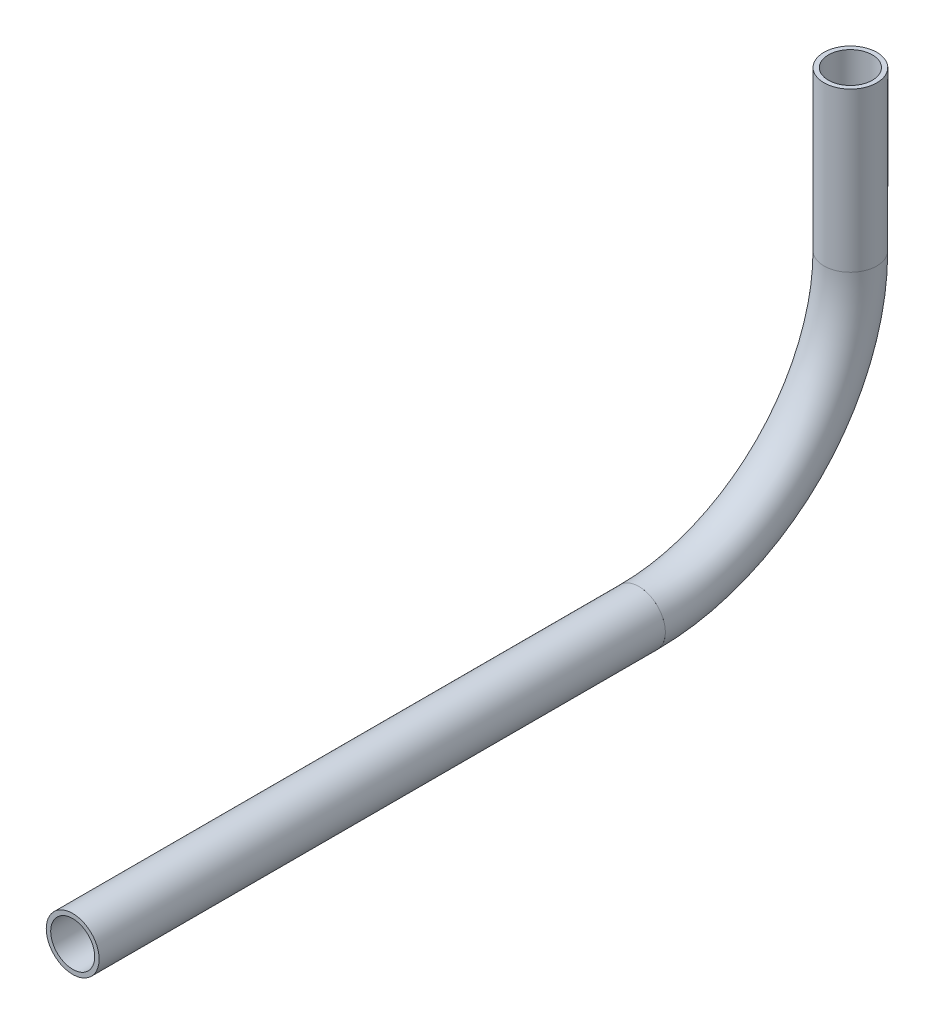
ISO-10303-21;
HEADER;
FILE_DESCRIPTION(('STEP AP214'),'2;1');
FILE_NAME('part.step','',(''),(''),'','','');
FILE_SCHEMA(('AUTOMOTIVE_DESIGN { 1 0 10303 214 1 1 1 1 }'));
ENDSEC;
DATA;
#1=APPLICATION_CONTEXT('core data for automotive mechanical design processes');
#2=APPLICATION_PROTOCOL_DEFINITION('international standard','automotive_design',2000,#1);
#3=PRODUCT_CONTEXT('',#1,'mechanical');
#4=PRODUCT('Part','Part','',(#3));
#5=PRODUCT_RELATED_PRODUCT_CATEGORY('part','',(#4));
#6=PRODUCT_DEFINITION_FORMATION('','',#4);
#7=PRODUCT_DEFINITION_CONTEXT('part definition',#1,'design');
#8=PRODUCT_DEFINITION('design','',#6,#7);
#9=PRODUCT_DEFINITION_SHAPE('','',#8);
#10=(LENGTH_UNIT() NAMED_UNIT(*) SI_UNIT(.MILLI.,.METRE.));
#11=(NAMED_UNIT(*) PLANE_ANGLE_UNIT() SI_UNIT($,.RADIAN.));
#12=(NAMED_UNIT(*) SI_UNIT($,.STERADIAN.) SOLID_ANGLE_UNIT());
#13=UNCERTAINTY_MEASURE_WITH_UNIT(LENGTH_MEASURE(1.E-05),#10,'distance_accuracy_value','');
#14=(GEOMETRIC_REPRESENTATION_CONTEXT(3) GLOBAL_UNCERTAINTY_ASSIGNED_CONTEXT((#13)) GLOBAL_UNIT_ASSIGNED_CONTEXT((#10,
#11,#12)) REPRESENTATION_CONTEXT('',''));
#15=CARTESIAN_POINT('',(0.,0.,0.));
#16=DIRECTION('',(0.,0.,1.));
#17=DIRECTION('',(1.,0.,0.));
#18=AXIS2_PLACEMENT_3D('',#15,#16,#17);
#19=CARTESIAN_POINT('',(0.,599.96001927236,167.15895807332));
#20=DIRECTION('',(0.,0.,1.));
#21=DIRECTION('',(1.,0.,0.));
#22=AXIS2_PLACEMENT_3D('',#19,#20,#21);
#23=CYLINDRICAL_SURFACE('',#22,5.28320000000004);
#24=CARTESIAN_POINT('',(0.,599.96001927236,303.16459571102));
#25=DIRECTION('',(0.,0.,-1.));
#26=DIRECTION('',(-1.,0.,0.));
#27=AXIS2_PLACEMENT_3D('',#24,#25,#26);
#28=CIRCLE('',#27,5.28320000000004);
#29=CARTESIAN_POINT('',(-5.28320000000004,599.96001927236,303.16459571102));
#30=VERTEX_POINT('',#29);
#31=EDGE_CURVE('E55',#30,#30,#28,.T.);
#32=ORIENTED_EDGE('',*,*,#31,.F.);
#33=EDGE_LOOP('',(#32));
#34=FACE_BOUND('',#33,.T.);
#35=CARTESIAN_POINT('',(0.,599.96001927236,167.15895807332));
#36=DIRECTION('',(0.,0.,-1.));
#37=DIRECTION('',(-1.,0.,0.));
#38=AXIS2_PLACEMENT_3D('',#35,#36,#37);
#39=CIRCLE('',#38,5.28320000000004);
#40=CARTESIAN_POINT('',(-5.28320000000004,599.96001927236,167.15895807332));
#41=VERTEX_POINT('',#40);
#42=EDGE_CURVE('E51',#41,#41,#39,.T.);
#43=ORIENTED_EDGE('',*,*,#42,.T.);
#44=EDGE_LOOP('',(#43));
#45=FACE_BOUND('',#44,.T.);
#46=ADVANCED_FACE('F47',(#34,#45),#23,.F.);
#47=CARTESIAN_POINT('',(0.,599.96001927236,167.15895807332));
#48=DIRECTION('',(0.,0.,1.));
#49=DIRECTION('',(1.,0.,0.));
#50=AXIS2_PLACEMENT_3D('',#47,#48,#49);
#51=CYLINDRICAL_SURFACE('',#50,6.35000000000005);
#52=CARTESIAN_POINT('',(0.,599.96001927236,303.16459571102));
#53=DIRECTION('',(0.,0.,-1.));
#54=DIRECTION('',(-1.,0.,0.));
#55=AXIS2_PLACEMENT_3D('',#52,#53,#54);
#56=CIRCLE('',#55,6.35000000000005);
#57=CARTESIAN_POINT('',(-6.35000000000005,599.96001927236,303.16459571102));
#58=VERTEX_POINT('',#57);
#59=EDGE_CURVE('E59',#58,#58,#56,.T.);
#60=ORIENTED_EDGE('',*,*,#59,.T.);
#61=EDGE_LOOP('',(#60));
#62=FACE_BOUND('',#61,.T.);
#63=CARTESIAN_POINT('',(0.,599.96001927236,167.15895807332));
#64=DIRECTION('',(0.,0.,-1.));
#65=DIRECTION('',(-1.,0.,0.));
#66=AXIS2_PLACEMENT_3D('',#63,#64,#65);
#67=CIRCLE('',#66,6.35000000000005);
#68=CARTESIAN_POINT('',(-6.35000000000005,599.96001927236,167.15895807332));
#69=VERTEX_POINT('',#68);
#70=EDGE_CURVE('E12',#69,#69,#67,.T.);
#71=ORIENTED_EDGE('',*,*,#70,.F.);
#72=EDGE_LOOP('',(#71));
#73=FACE_BOUND('',#72,.T.);
#74=ADVANCED_FACE('F74',(#62,#73),#51,.T.);
#75=CARTESIAN_POINT('',(0.,599.96001927236,303.16459571102));
#76=DIRECTION('',(0.,0.,-1.));
#77=DIRECTION('',(-1.,0.,0.));
#78=AXIS2_PLACEMENT_3D('',#75,#76,#77);
#79=PLANE('',#78);
#80=ORIENTED_EDGE('',*,*,#31,.T.);
#81=EDGE_LOOP('',(#80));
#82=FACE_BOUND('',#81,.T.);
#83=ORIENTED_EDGE('',*,*,#59,.F.);
#84=EDGE_LOOP('',(#83));
#85=FACE_BOUND('',#84,.T.);
#86=ADVANCED_FACE('F70',(#82,#85),#79,.F.);
#87=CARTESIAN_POINT('',(0.,599.96001927236,167.15895807332));
#88=DIRECTION('',(0.,0.,-1.));
#89=DIRECTION('',(-1.,0.,0.));
#90=AXIS2_PLACEMENT_3D('',#87,#88,#89);
#91=PLANE('',#90);
#92=ORIENTED_EDGE('',*,*,#42,.F.);
#93=EDGE_LOOP('',(#92));
#94=FACE_BOUND('',#93,.T.);
#95=ORIENTED_EDGE('',*,*,#70,.T.);
#96=EDGE_LOOP('',(#95));
#97=FACE_BOUND('',#96,.T.);
#98=ADVANCED_FACE('F49',(#94,#97),#91,.T.);
#99=CLOSED_SHELL('',(#46,#74,#86,#98));
#100=MANIFOLD_SOLID_BREP('B2',#99);
#101=CARTESIAN_POINT('',(0.,650.76001927236,167.15895807332));
#102=DIRECTION('',(-1.,0.,0.));
#103=DIRECTION('',(0.,0.,1.));
#104=AXIS2_PLACEMENT_3D('',#101,#102,#103);
#105=TOROIDAL_SURFACE('',#104,50.8,5.28320000000004);
#106=CARTESIAN_POINT('',(0.,650.76001927236,116.35895807332));
#107=DIRECTION('',(0.,1.,0.));
#108=DIRECTION('',(0.,0.,1.));
#109=AXIS2_PLACEMENT_3D('',#106,#107,#108);
#110=CIRCLE('',#109,5.28320000000004);
#111=CARTESIAN_POINT('',(0.,650.76001927236,111.07575807332));
#112=VERTEX_POINT('',#111);
#113=EDGE_CURVE('E150',#112,#112,#110,.T.);
#114=CARTESIAN_POINT('',(0.,599.96001927236,167.15895807332));
#115=DIRECTION('',(0.,0.,1.));
#116=DIRECTION('',(1.,0.,0.));
#117=AXIS2_PLACEMENT_3D('',#114,#115,#116);
#118=CIRCLE('',#117,5.28320000000004);
#119=CARTESIAN_POINT('',(0.,594.67681927236,167.15895807332));
#120=VERTEX_POINT('',#119);
#121=EDGE_CURVE('E140',#120,#120,#118,.T.);
#122=CARTESIAN_POINT('',(0.,650.76001927236,167.15895807332));
#123=DIRECTION('',(-1.,0.,0.));
#124=DIRECTION('',(0.,0.,1.));
#125=AXIS2_PLACEMENT_3D('',#122,#123,#124);
#126=CIRCLE('',#125,56.0832000000001);
#127=EDGE_CURVE('',#112,#120,#126,.T.);
#128=ORIENTED_EDGE('',*,*,#113,.T.);
#129=ORIENTED_EDGE('',*,*,#121,.T.);
#130=ORIENTED_EDGE('',*,*,#127,.T.);
#131=ORIENTED_EDGE('',*,*,#127,.F.);
#132=EDGE_LOOP('',(#128,#130,#129,#131));
#133=FACE_BOUND('',#132,.T.);
#134=ADVANCED_FACE('F136',(#133),#105,.F.);
#135=CARTESIAN_POINT('',(0.,650.76001927236,167.15895807332));
#136=DIRECTION('',(-1.,0.,0.));
#137=DIRECTION('',(0.,0.,1.));
#138=AXIS2_PLACEMENT_3D('',#135,#136,#137);
#139=TOROIDAL_SURFACE('',#138,50.8,6.35000000000005);
#140=CARTESIAN_POINT('',(0.,650.76001927236,116.35895807332));
#141=DIRECTION('',(0.,1.,0.));
#142=DIRECTION('',(0.,0.,1.));
#143=AXIS2_PLACEMENT_3D('',#140,#141,#142);
#144=CIRCLE('',#143,6.35000000000005);
#145=CARTESIAN_POINT('',(0.,650.76001927236,110.00895807332));
#146=VERTEX_POINT('',#145);
#147=EDGE_CURVE('E144',#146,#146,#144,.T.);
#148=CARTESIAN_POINT('',(0.,599.96001927236,167.15895807332));
#149=DIRECTION('',(0.,0.,1.));
#150=DIRECTION('',(1.,0.,0.));
#151=AXIS2_PLACEMENT_3D('',#148,#149,#150);
#152=CIRCLE('',#151,6.35000000000005);
#153=CARTESIAN_POINT('',(0.,593.61001927236,167.15895807332));
#154=VERTEX_POINT('',#153);
#155=EDGE_CURVE('E46',#154,#154,#152,.T.);
#156=CARTESIAN_POINT('',(0.,650.76001927236,167.15895807332));
#157=DIRECTION('',(-1.,0.,0.));
#158=DIRECTION('',(0.,0.,1.));
#159=AXIS2_PLACEMENT_3D('',#156,#157,#158);
#160=CIRCLE('',#159,57.1500000000001);
#161=EDGE_CURVE('',#146,#154,#160,.T.);
#162=ORIENTED_EDGE('',*,*,#147,.F.);
#163=ORIENTED_EDGE('',*,*,#155,.F.);
#164=ORIENTED_EDGE('',*,*,#161,.T.);
#165=ORIENTED_EDGE('',*,*,#161,.F.);
#166=EDGE_LOOP('',(#162,#164,#163,#165));
#167=FACE_BOUND('',#166,.T.);
#168=ADVANCED_FACE('F163',(#167),#139,.T.);
#169=CARTESIAN_POINT('',(0.,650.76001927236,116.35895807332));
#170=DIRECTION('',(0.,1.,0.));
#171=DIRECTION('',(0.,0.,1.));
#172=AXIS2_PLACEMENT_3D('',#169,#170,#171);
#173=PLANE('',#172);
#174=ORIENTED_EDGE('',*,*,#113,.F.);
#175=EDGE_LOOP('',(#174));
#176=FACE_BOUND('',#175,.T.);
#177=ORIENTED_EDGE('',*,*,#147,.T.);
#178=EDGE_LOOP('',(#177));
#179=FACE_BOUND('',#178,.T.);
#180=ADVANCED_FACE('F159',(#176,#179),#173,.T.);
#181=CARTESIAN_POINT('',(0.,599.96001927236,167.15895807332));
#182=DIRECTION('',(0.,0.,1.));
#183=DIRECTION('',(1.,0.,0.));
#184=AXIS2_PLACEMENT_3D('',#181,#182,#183);
#185=PLANE('',#184);
#186=ORIENTED_EDGE('',*,*,#121,.F.);
#187=EDGE_LOOP('',(#186));
#188=FACE_BOUND('',#187,.T.);
#189=ORIENTED_EDGE('',*,*,#155,.T.);
#190=EDGE_LOOP('',(#189));
#191=FACE_BOUND('',#190,.T.);
#192=ADVANCED_FACE('F138',(#188,#191),#185,.T.);
#193=CLOSED_SHELL('',(#134,#168,#180,#192));
#194=MANIFOLD_SOLID_BREP('B7',#193);
#195=CARTESIAN_POINT('',(0.,688.86001927236,116.35895807332));
#196=DIRECTION('',(0.,-1.,0.));
#197=DIRECTION('',(0.,0.,-1.));
#198=AXIS2_PLACEMENT_3D('',#195,#196,#197);
#199=CYLINDRICAL_SURFACE('',#198,5.28320000000004);
#200=CARTESIAN_POINT('',(0.,688.86001927236,116.35895807332));
#201=DIRECTION('',(0.,1.,0.));
#202=DIRECTION('',(-1.,0.,0.));
#203=AXIS2_PLACEMENT_3D('',#200,#201,#202);
#204=CIRCLE('',#203,5.28320000000004);
#205=CARTESIAN_POINT('',(-5.28320000000004,688.86001927236,116.35895807332));
#206=VERTEX_POINT('',#205);
#207=EDGE_CURVE('E234',#206,#206,#204,.T.);
#208=ORIENTED_EDGE('',*,*,#207,.T.);
#209=EDGE_LOOP('',(#208));
#210=FACE_BOUND('',#209,.T.);
#211=CARTESIAN_POINT('',(0.,650.76001927236,116.35895807332));
#212=DIRECTION('',(0.,-1.,0.));
#213=DIRECTION('',(0.,0.,-1.));
#214=AXIS2_PLACEMENT_3D('',#211,#212,#213);
#215=CIRCLE('',#214,5.28320000000004);
#216=CARTESIAN_POINT('',(0.,650.76001927236,111.07575807332));
#217=VERTEX_POINT('',#216);
#218=EDGE_CURVE('E224',#217,#217,#215,.T.);
#219=ORIENTED_EDGE('',*,*,#218,.T.);
#220=EDGE_LOOP('',(#219));
#221=FACE_BOUND('',#220,.T.);
#222=ADVANCED_FACE('F220',(#210,#221),#199,.F.);
#223=CARTESIAN_POINT('',(0.,688.86001927236,116.35895807332));
#224=DIRECTION('',(0.,-1.,0.));
#225=DIRECTION('',(0.,0.,-1.));
#226=AXIS2_PLACEMENT_3D('',#223,#224,#225);
#227=CYLINDRICAL_SURFACE('',#226,6.35000000000005);
#228=CARTESIAN_POINT('',(0.,688.86001927236,116.35895807332));
#229=DIRECTION('',(0.,1.,0.));
#230=DIRECTION('',(-1.,0.,0.));
#231=AXIS2_PLACEMENT_3D('',#228,#229,#230);
#232=CIRCLE('',#231,6.35000000000005);
#233=CARTESIAN_POINT('',(-6.35000000000005,688.86001927236,116.35895807332));
#234=VERTEX_POINT('',#233);
#235=EDGE_CURVE('E228',#234,#234,#232,.T.);
#236=ORIENTED_EDGE('',*,*,#235,.F.);
#237=EDGE_LOOP('',(#236));
#238=FACE_BOUND('',#237,.T.);
#239=CARTESIAN_POINT('',(0.,650.76001927236,116.35895807332));
#240=DIRECTION('',(0.,-1.,0.));
#241=DIRECTION('',(0.,0.,-1.));
#242=AXIS2_PLACEMENT_3D('',#239,#240,#241);
#243=CIRCLE('',#242,6.35000000000005);
#244=CARTESIAN_POINT('',(0.,650.76001927236,110.00895807332));
#245=VERTEX_POINT('',#244);
#246=EDGE_CURVE('E135',#245,#245,#243,.T.);
#247=ORIENTED_EDGE('',*,*,#246,.F.);
#248=EDGE_LOOP('',(#247));
#249=FACE_BOUND('',#248,.T.);
#250=ADVANCED_FACE('F247',(#238,#249),#227,.T.);
#251=CARTESIAN_POINT('',(0.,688.86001927236,116.35895807332));
#252=DIRECTION('',(0.,1.,0.));
#253=DIRECTION('',(-1.,0.,0.));
#254=AXIS2_PLACEMENT_3D('',#251,#252,#253);
#255=PLANE('',#254);
#256=ORIENTED_EDGE('',*,*,#207,.F.);
#257=EDGE_LOOP('',(#256));
#258=FACE_BOUND('',#257,.T.);
#259=ORIENTED_EDGE('',*,*,#235,.T.);
#260=EDGE_LOOP('',(#259));
#261=FACE_BOUND('',#260,.T.);
#262=ADVANCED_FACE('F243',(#258,#261),#255,.T.);
#263=CARTESIAN_POINT('',(0.,650.76001927236,116.35895807332));
#264=DIRECTION('',(0.,-1.,0.));
#265=DIRECTION('',(0.,0.,-1.));
#266=AXIS2_PLACEMENT_3D('',#263,#264,#265);
#267=PLANE('',#266);
#268=ORIENTED_EDGE('',*,*,#218,.F.);
#269=EDGE_LOOP('',(#268));
#270=FACE_BOUND('',#269,.T.);
#271=ORIENTED_EDGE('',*,*,#246,.T.);
#272=EDGE_LOOP('',(#271));
#273=FACE_BOUND('',#272,.T.);
#274=ADVANCED_FACE('F222',(#270,#273),#267,.T.);
#275=CLOSED_SHELL('',(#222,#250,#262,#274));
#276=MANIFOLD_SOLID_BREP('B41',#275);
#277=ADVANCED_BREP_SHAPE_REPRESENTATION('',(#18,#100,#194,#276),#14);
#278=SHAPE_DEFINITION_REPRESENTATION(#9,#277);
ENDSEC;
END-ISO-10303-21;
